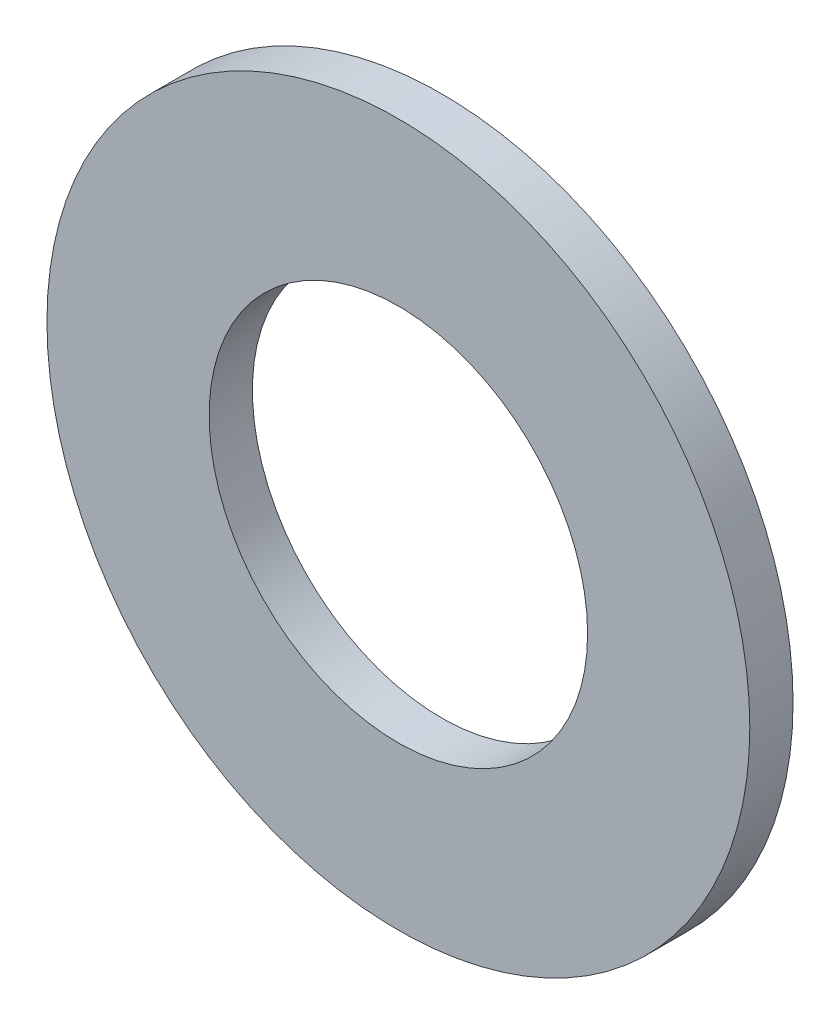
ISO-10303-21;
HEADER;
FILE_DESCRIPTION(('STEP AP214'),'2;1');
FILE_NAME('part.step','',(''),(''),'','','');
FILE_SCHEMA(('AUTOMOTIVE_DESIGN { 1 0 10303 214 1 1 1 1 }'));
ENDSEC;
DATA;
#1=APPLICATION_CONTEXT('core data for automotive mechanical design processes');
#2=APPLICATION_PROTOCOL_DEFINITION('international standard','automotive_design',2000,#1);
#3=PRODUCT_CONTEXT('',#1,'mechanical');
#4=PRODUCT('Part','Part','',(#3));
#5=PRODUCT_RELATED_PRODUCT_CATEGORY('part','',(#4));
#6=PRODUCT_DEFINITION_FORMATION('','',#4);
#7=PRODUCT_DEFINITION_CONTEXT('part definition',#1,'design');
#8=PRODUCT_DEFINITION('design','',#6,#7);
#9=PRODUCT_DEFINITION_SHAPE('','',#8);
#10=(LENGTH_UNIT() NAMED_UNIT(*) SI_UNIT(.MILLI.,.METRE.));
#11=(NAMED_UNIT(*) PLANE_ANGLE_UNIT() SI_UNIT($,.RADIAN.));
#12=(NAMED_UNIT(*) SI_UNIT($,.STERADIAN.) SOLID_ANGLE_UNIT());
#13=UNCERTAINTY_MEASURE_WITH_UNIT(LENGTH_MEASURE(1.E-05),#10,'distance_accuracy_value','');
#14=(GEOMETRIC_REPRESENTATION_CONTEXT(3) GLOBAL_UNCERTAINTY_ASSIGNED_CONTEXT((#13)) GLOBAL_UNIT_ASSIGNED_CONTEXT((#10,
#11,#12)) REPRESENTATION_CONTEXT('',''));
#15=CARTESIAN_POINT('',(0.,0.,0.));
#16=DIRECTION('',(0.,0.,1.));
#17=DIRECTION('',(1.,0.,0.));
#18=AXIS2_PLACEMENT_3D('',#15,#16,#17);
#19=CARTESIAN_POINT('',(0.,0.,4.));
#20=DIRECTION('',(0.,0.,1.));
#21=DIRECTION('',(1.,0.,0.));
#22=AXIS2_PLACEMENT_3D('',#19,#20,#21);
#23=PLANE('',#22);
#24=CARTESIAN_POINT('',(0.,0.,4.));
#25=DIRECTION('',(0.,0.,1.));
#26=DIRECTION('',(1.,0.,0.));
#27=AXIS2_PLACEMENT_3D('',#24,#25,#26);
#28=CIRCLE('',#27,32.5);
#29=CARTESIAN_POINT('',(32.5,0.,4.));
#30=VERTEX_POINT('',#29);
#31=EDGE_CURVE('E10',#30,#30,#28,.T.);
#32=ORIENTED_EDGE('',*,*,#31,.T.);
#33=EDGE_LOOP('',(#32));
#34=FACE_BOUND('',#33,.T.);
#35=CARTESIAN_POINT('',(0.,0.,4.));
#36=DIRECTION('',(0.,0.,1.));
#37=DIRECTION('',(1.,0.,0.));
#38=AXIS2_PLACEMENT_3D('',#35,#36,#37);
#39=CIRCLE('',#38,17.5);
#40=CARTESIAN_POINT('',(17.5,0.,4.));
#41=VERTEX_POINT('',#40);
#42=EDGE_CURVE('E44',#41,#41,#39,.T.);
#43=ORIENTED_EDGE('',*,*,#42,.F.);
#44=EDGE_LOOP('',(#43));
#45=FACE_BOUND('',#44,.T.);
#46=ADVANCED_FACE('F33',(#34,#45),#23,.T.);
#47=CARTESIAN_POINT('',(0.,0.,0.));
#48=DIRECTION('',(0.,0.,1.));
#49=DIRECTION('',(1.,0.,0.));
#50=AXIS2_PLACEMENT_3D('',#47,#48,#49);
#51=PLANE('',#50);
#52=CARTESIAN_POINT('',(0.,0.,0.));
#53=DIRECTION('',(0.,0.,1.));
#54=DIRECTION('',(1.,0.,0.));
#55=AXIS2_PLACEMENT_3D('',#52,#53,#54);
#56=CIRCLE('',#55,32.5);
#57=CARTESIAN_POINT('',(32.5,0.,0.));
#58=VERTEX_POINT('',#57);
#59=EDGE_CURVE('E37',#58,#58,#56,.T.);
#60=ORIENTED_EDGE('',*,*,#59,.F.);
#61=EDGE_LOOP('',(#60));
#62=FACE_BOUND('',#61,.T.);
#63=CARTESIAN_POINT('',(0.,0.,0.));
#64=DIRECTION('',(0.,0.,1.));
#65=DIRECTION('',(1.,0.,0.));
#66=AXIS2_PLACEMENT_3D('',#63,#64,#65);
#67=CIRCLE('',#66,17.5);
#68=CARTESIAN_POINT('',(17.5,0.,0.));
#69=VERTEX_POINT('',#68);
#70=EDGE_CURVE('E46',#69,#69,#67,.T.);
#71=ORIENTED_EDGE('',*,*,#70,.T.);
#72=EDGE_LOOP('',(#71));
#73=FACE_BOUND('',#72,.T.);
#74=ADVANCED_FACE('F56',(#62,#73),#51,.F.);
#75=CARTESIAN_POINT('',(0.,0.,4.));
#76=DIRECTION('',(0.,0.,-1.));
#77=DIRECTION('',(-1.,0.,0.));
#78=AXIS2_PLACEMENT_3D('',#75,#76,#77);
#79=CYLINDRICAL_SURFACE('',#78,32.5);
#80=ORIENTED_EDGE('',*,*,#31,.F.);
#81=EDGE_LOOP('',(#80));
#82=FACE_BOUND('',#81,.T.);
#83=ORIENTED_EDGE('',*,*,#59,.T.);
#84=EDGE_LOOP('',(#83));
#85=FACE_BOUND('',#84,.T.);
#86=ADVANCED_FACE('F35',(#82,#85),#79,.T.);
#87=CARTESIAN_POINT('',(0.,0.,4.));
#88=DIRECTION('',(0.,0.,-1.));
#89=DIRECTION('',(-1.,0.,0.));
#90=AXIS2_PLACEMENT_3D('',#87,#88,#89);
#91=CYLINDRICAL_SURFACE('',#90,17.5);
#92=ORIENTED_EDGE('',*,*,#42,.T.);
#93=EDGE_LOOP('',(#92));
#94=FACE_BOUND('',#93,.T.);
#95=ORIENTED_EDGE('',*,*,#70,.F.);
#96=EDGE_LOOP('',(#95));
#97=FACE_BOUND('',#96,.T.);
#98=ADVANCED_FACE('F52',(#94,#97),#91,.F.);
#99=CLOSED_SHELL('',(#46,#74,#86,#98));
#100=MANIFOLD_SOLID_BREP('B2',#99);
#101=ADVANCED_BREP_SHAPE_REPRESENTATION('',(#18,#100),#14);
#102=SHAPE_DEFINITION_REPRESENTATION(#9,#101);
ENDSEC;
END-ISO-10303-21;
